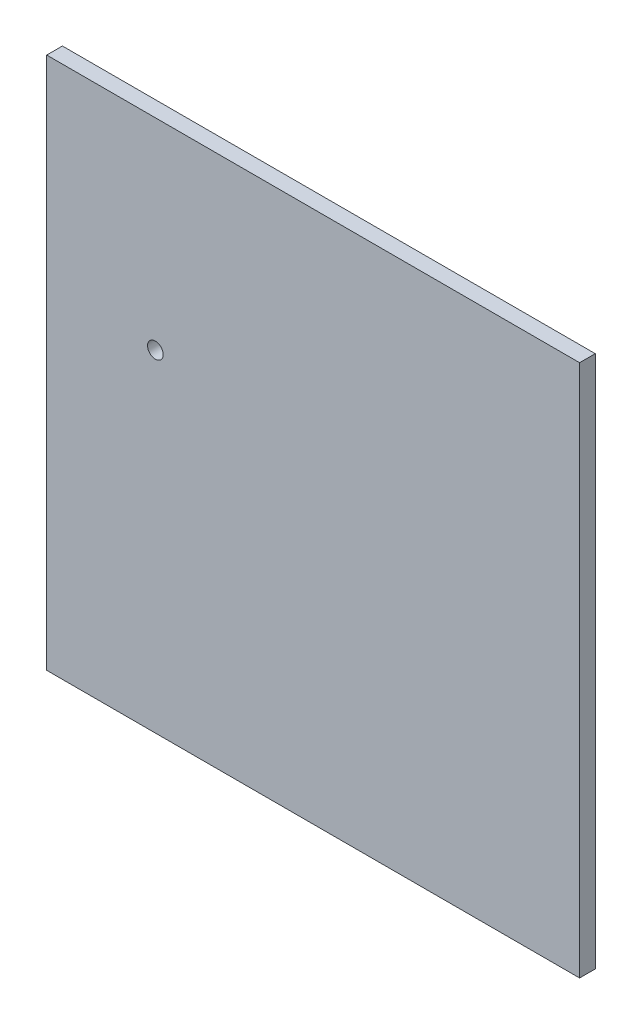
ISO-10303-21;
HEADER;
FILE_DESCRIPTION(('STEP AP214'),'2;1');
FILE_NAME('part.step','',(''),(''),'','','');
FILE_SCHEMA(('AUTOMOTIVE_DESIGN { 1 0 10303 214 1 1 1 1 }'));
ENDSEC;
DATA;
#1=APPLICATION_CONTEXT('core data for automotive mechanical design processes');
#2=APPLICATION_PROTOCOL_DEFINITION('international standard','automotive_design',2000,#1);
#3=PRODUCT_CONTEXT('',#1,'mechanical');
#4=PRODUCT('Part','Part','',(#3));
#5=PRODUCT_RELATED_PRODUCT_CATEGORY('part','',(#4));
#6=PRODUCT_DEFINITION_FORMATION('','',#4);
#7=PRODUCT_DEFINITION_CONTEXT('part definition',#1,'design');
#8=PRODUCT_DEFINITION('design','',#6,#7);
#9=PRODUCT_DEFINITION_SHAPE('','',#8);
#10=(LENGTH_UNIT() NAMED_UNIT(*) SI_UNIT(.MILLI.,.METRE.));
#11=(NAMED_UNIT(*) PLANE_ANGLE_UNIT() SI_UNIT($,.RADIAN.));
#12=(NAMED_UNIT(*) SI_UNIT($,.STERADIAN.) SOLID_ANGLE_UNIT());
#13=UNCERTAINTY_MEASURE_WITH_UNIT(LENGTH_MEASURE(1.E-05),#10,'distance_accuracy_value','');
#14=(GEOMETRIC_REPRESENTATION_CONTEXT(3) GLOBAL_UNCERTAINTY_ASSIGNED_CONTEXT((#13)) GLOBAL_UNIT_ASSIGNED_CONTEXT((#10,
#11,#12)) REPRESENTATION_CONTEXT('',''));
#15=CARTESIAN_POINT('',(0.,0.,0.));
#16=DIRECTION('',(0.,0.,1.));
#17=DIRECTION('',(1.,0.,0.));
#18=AXIS2_PLACEMENT_3D('',#15,#16,#17);
#19=CARTESIAN_POINT('',(17.,17.,1.));
#20=DIRECTION('',(0.,-1.,0.));
#21=DIRECTION('',(0.,0.,-1.));
#22=AXIS2_PLACEMENT_3D('',#19,#20,#21);
#23=PLANE('',#22);
#24=DIRECTION('',(-1.,0.,0.));
#25=VECTOR('',#24,1.);
#26=CARTESIAN_POINT('',(17.,17.,0.));
#27=LINE('',#26,#25);
#28=CARTESIAN_POINT('',(17.,17.,0.));
#29=VERTEX_POINT('',#28);
#30=CARTESIAN_POINT('',(-17.,17.,0.));
#31=VERTEX_POINT('',#30);
#32=EDGE_CURVE('E106',#29,#31,#27,.T.);
#33=ORIENTED_EDGE('',*,*,#32,.T.);
#34=DIRECTION('',(0.,0.,-1.));
#35=VECTOR('',#34,1.);
#36=CARTESIAN_POINT('',(-17.,17.,1.));
#37=LINE('',#36,#35);
#38=CARTESIAN_POINT('',(-17.,17.,1.));
#39=VERTEX_POINT('',#38);
#40=EDGE_CURVE('E11',#39,#31,#37,.T.);
#41=ORIENTED_EDGE('',*,*,#40,.F.);
#42=DIRECTION('',(-1.,0.,0.));
#43=VECTOR('',#42,1.);
#44=CARTESIAN_POINT('',(17.,17.,1.));
#45=LINE('',#44,#43);
#46=CARTESIAN_POINT('',(17.,17.,1.));
#47=VERTEX_POINT('',#46);
#48=EDGE_CURVE('E94',#47,#39,#45,.T.);
#49=ORIENTED_EDGE('',*,*,#48,.F.);
#50=DIRECTION('',(0.,0.,-1.));
#51=VECTOR('',#50,1.);
#52=CARTESIAN_POINT('',(17.,17.,1.));
#53=LINE('',#52,#51);
#54=EDGE_CURVE('E102',#47,#29,#53,.T.);
#55=ORIENTED_EDGE('',*,*,#54,.T.);
#56=EDGE_LOOP('',(#33,#41,#49,#55));
#57=FACE_BOUND('',#56,.T.);
#58=ADVANCED_FACE('F43',(#57),#23,.F.);
#59=CARTESIAN_POINT('',(-17.,-17.,1.));
#60=DIRECTION('',(1.,0.,0.));
#61=DIRECTION('',(0.,0.,-1.));
#62=AXIS2_PLACEMENT_3D('',#59,#60,#61);
#63=PLANE('',#62);
#64=DIRECTION('',(0.,-1.,0.));
#65=VECTOR('',#64,1.);
#66=CARTESIAN_POINT('',(-17.,-17.,0.));
#67=LINE('',#66,#65);
#68=CARTESIAN_POINT('',(-17.,-17.,0.));
#69=VERTEX_POINT('',#68);
#70=EDGE_CURVE('E98',#31,#69,#67,.T.);
#71=ORIENTED_EDGE('',*,*,#70,.T.);
#72=DIRECTION('',(0.,0.,-1.));
#73=VECTOR('',#72,1.);
#74=CARTESIAN_POINT('',(-17.,-17.,1.));
#75=LINE('',#74,#73);
#76=CARTESIAN_POINT('',(-17.,-17.,1.));
#77=VERTEX_POINT('',#76);
#78=EDGE_CURVE('E51',#77,#69,#75,.T.);
#79=ORIENTED_EDGE('',*,*,#78,.F.);
#80=DIRECTION('',(0.,-1.,0.));
#81=VECTOR('',#80,1.);
#82=CARTESIAN_POINT('',(-17.,-17.,1.));
#83=LINE('',#82,#81);
#84=EDGE_CURVE('E89',#39,#77,#83,.T.);
#85=ORIENTED_EDGE('',*,*,#84,.F.);
#86=ORIENTED_EDGE('',*,*,#40,.T.);
#87=EDGE_LOOP('',(#71,#79,#85,#86));
#88=FACE_BOUND('',#87,.T.);
#89=ADVANCED_FACE('F97',(#88),#63,.F.);
#90=CARTESIAN_POINT('',(17.,-17.,1.));
#91=DIRECTION('',(0.,1.,0.));
#92=DIRECTION('',(0.,0.,1.));
#93=AXIS2_PLACEMENT_3D('',#90,#91,#92);
#94=PLANE('',#93);
#95=DIRECTION('',(1.,0.,0.));
#96=VECTOR('',#95,1.);
#97=CARTESIAN_POINT('',(17.,-17.,0.));
#98=LINE('',#97,#96);
#99=CARTESIAN_POINT('',(17.,-17.,0.));
#100=VERTEX_POINT('',#99);
#101=EDGE_CURVE('E76',#69,#100,#98,.T.);
#102=ORIENTED_EDGE('',*,*,#101,.T.);
#103=DIRECTION('',(0.,0.,-1.));
#104=VECTOR('',#103,1.);
#105=CARTESIAN_POINT('',(17.,-17.,1.));
#106=LINE('',#105,#104);
#107=CARTESIAN_POINT('',(17.,-17.,1.));
#108=VERTEX_POINT('',#107);
#109=EDGE_CURVE('E99',#108,#100,#106,.T.);
#110=ORIENTED_EDGE('',*,*,#109,.F.);
#111=DIRECTION('',(1.,0.,0.));
#112=VECTOR('',#111,1.);
#113=CARTESIAN_POINT('',(17.,-17.,1.));
#114=LINE('',#113,#112);
#115=EDGE_CURVE('E92',#77,#108,#114,.T.);
#116=ORIENTED_EDGE('',*,*,#115,.F.);
#117=ORIENTED_EDGE('',*,*,#78,.T.);
#118=EDGE_LOOP('',(#102,#110,#116,#117));
#119=FACE_BOUND('',#118,.T.);
#120=ADVANCED_FACE('F100',(#119),#94,.F.);
#121=CARTESIAN_POINT('',(17.,-17.,1.));
#122=DIRECTION('',(-1.,0.,0.));
#123=DIRECTION('',(0.,0.,1.));
#124=AXIS2_PLACEMENT_3D('',#121,#122,#123);
#125=PLANE('',#124);
#126=DIRECTION('',(0.,1.,0.));
#127=VECTOR('',#126,1.);
#128=CARTESIAN_POINT('',(17.,-17.,0.));
#129=LINE('',#128,#127);
#130=EDGE_CURVE('E82',#100,#29,#129,.T.);
#131=ORIENTED_EDGE('',*,*,#130,.T.);
#132=ORIENTED_EDGE('',*,*,#54,.F.);
#133=DIRECTION('',(0.,1.,0.));
#134=VECTOR('',#133,1.);
#135=CARTESIAN_POINT('',(17.,-17.,1.));
#136=LINE('',#135,#134);
#137=EDGE_CURVE('E59',#108,#47,#136,.T.);
#138=ORIENTED_EDGE('',*,*,#137,.F.);
#139=ORIENTED_EDGE('',*,*,#109,.T.);
#140=EDGE_LOOP('',(#131,#132,#138,#139));
#141=FACE_BOUND('',#140,.T.);
#142=ADVANCED_FACE('F114',(#141),#125,.F.);
#143=CARTESIAN_POINT('',(0.,0.,1.));
#144=DIRECTION('',(0.,0.,-1.));
#145=DIRECTION('',(-1.,0.,0.));
#146=AXIS2_PLACEMENT_3D('',#143,#144,#145);
#147=PLANE('',#146);
#148=CARTESIAN_POINT('',(-10.0676540105553,4.16018437454113,1.));
#149=DIRECTION('',(0.,0.,1.));
#150=DIRECTION('',(1.,0.,0.));
#151=AXIS2_PLACEMENT_3D('',#148,#149,#150);
#152=CIRCLE('',#151,0.500000000000001);
#153=CARTESIAN_POINT('',(-9.56765401055532,4.16018437454113,1.));
#154=VERTEX_POINT('',#153);
#155=EDGE_CURVE('E120',#154,#154,#152,.T.);
#156=ORIENTED_EDGE('',*,*,#155,.F.);
#157=EDGE_LOOP('',(#156));
#158=FACE_BOUND('',#157,.T.);
#159=ORIENTED_EDGE('',*,*,#48,.T.);
#160=ORIENTED_EDGE('',*,*,#84,.T.);
#161=ORIENTED_EDGE('',*,*,#115,.T.);
#162=ORIENTED_EDGE('',*,*,#137,.T.);
#163=EDGE_LOOP('',(#159,#160,#161,#162));
#164=FACE_BOUND('',#163,.T.);
#165=ADVANCED_FACE('F90',(#158,#164),#147,.F.);
#166=CARTESIAN_POINT('',(0.,0.,0.));
#167=DIRECTION('',(0.,0.,-1.));
#168=DIRECTION('',(-1.,0.,0.));
#169=AXIS2_PLACEMENT_3D('',#166,#167,#168);
#170=PLANE('',#169);
#171=CARTESIAN_POINT('',(-10.0676540105553,4.16018437454113,0.));
#172=DIRECTION('',(0.,0.,1.));
#173=DIRECTION('',(1.,0.,0.));
#174=AXIS2_PLACEMENT_3D('',#171,#172,#173);
#175=CIRCLE('',#174,0.500000000000001);
#176=CARTESIAN_POINT('',(-9.56765401055532,4.16018437454113,0.));
#177=VERTEX_POINT('',#176);
#178=EDGE_CURVE('E109',#177,#177,#175,.T.);
#179=ORIENTED_EDGE('',*,*,#178,.T.);
#180=EDGE_LOOP('',(#179));
#181=FACE_BOUND('',#180,.T.);
#182=ORIENTED_EDGE('',*,*,#32,.F.);
#183=ORIENTED_EDGE('',*,*,#130,.F.);
#184=ORIENTED_EDGE('',*,*,#101,.F.);
#185=ORIENTED_EDGE('',*,*,#70,.F.);
#186=EDGE_LOOP('',(#182,#183,#184,#185));
#187=FACE_BOUND('',#186,.T.);
#188=ADVANCED_FACE('F117',(#181,#187),#170,.T.);
#189=CARTESIAN_POINT('',(-10.0676540105553,4.16018437454113,0.));
#190=DIRECTION('',(0.,0.,1.));
#191=DIRECTION('',(1.,0.,0.));
#192=AXIS2_PLACEMENT_3D('',#189,#190,#191);
#193=CYLINDRICAL_SURFACE('',#192,0.500000000000001);
#194=ORIENTED_EDGE('',*,*,#178,.F.);
#195=EDGE_LOOP('',(#194));
#196=FACE_BOUND('',#195,.T.);
#197=ORIENTED_EDGE('',*,*,#155,.T.);
#198=EDGE_LOOP('',(#197));
#199=FACE_BOUND('',#198,.T.);
#200=ADVANCED_FACE('F127',(#196,#199),#193,.F.);
#201=CLOSED_SHELL('',(#58,#89,#120,#142,#165,#188,#200));
#202=MANIFOLD_SOLID_BREP('B2',#201);
#203=ADVANCED_BREP_SHAPE_REPRESENTATION('',(#18,#202),#14);
#204=SHAPE_DEFINITION_REPRESENTATION(#9,#203);
ENDSEC;
END-ISO-10303-21;
